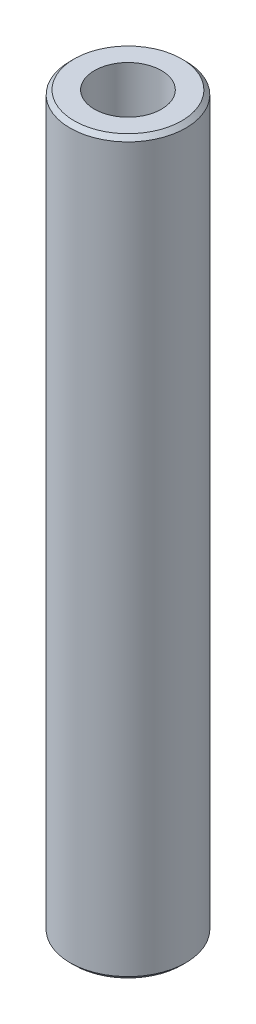
ISO-10303-21;
HEADER;
FILE_DESCRIPTION(('STEP AP214'),'2;1');
FILE_NAME('part.step','',(''),(''),'','','');
FILE_SCHEMA(('AUTOMOTIVE_DESIGN { 1 0 10303 214 1 1 1 1 }'));
ENDSEC;
DATA;
#1=APPLICATION_CONTEXT('core data for automotive mechanical design processes');
#2=APPLICATION_PROTOCOL_DEFINITION('international standard','automotive_design',2000,#1);
#3=PRODUCT_CONTEXT('',#1,'mechanical');
#4=PRODUCT('Part','Part','',(#3));
#5=PRODUCT_RELATED_PRODUCT_CATEGORY('part','',(#4));
#6=PRODUCT_DEFINITION_FORMATION('','',#4);
#7=PRODUCT_DEFINITION_CONTEXT('part definition',#1,'design');
#8=PRODUCT_DEFINITION('design','',#6,#7);
#9=PRODUCT_DEFINITION_SHAPE('','',#8);
#10=(LENGTH_UNIT() NAMED_UNIT(*) SI_UNIT(.MILLI.,.METRE.));
#11=(NAMED_UNIT(*) PLANE_ANGLE_UNIT() SI_UNIT($,.RADIAN.));
#12=(NAMED_UNIT(*) SI_UNIT($,.STERADIAN.) SOLID_ANGLE_UNIT());
#13=UNCERTAINTY_MEASURE_WITH_UNIT(LENGTH_MEASURE(1.E-05),#10,'distance_accuracy_value','');
#14=(GEOMETRIC_REPRESENTATION_CONTEXT(3) GLOBAL_UNCERTAINTY_ASSIGNED_CONTEXT((#13)) GLOBAL_UNIT_ASSIGNED_CONTEXT((#10,
#11,#12)) REPRESENTATION_CONTEXT('',''));
#15=CARTESIAN_POINT('',(0.,0.,0.));
#16=DIRECTION('',(0.,0.,1.));
#17=DIRECTION('',(1.,0.,0.));
#18=AXIS2_PLACEMENT_3D('',#15,#16,#17);
#19=CARTESIAN_POINT('',(0.,600.,0.));
#20=DIRECTION('',(0.,-1.,0.));
#21=DIRECTION('',(0.,0.,-1.));
#22=AXIS2_PLACEMENT_3D('',#19,#20,#21);
#23=CYLINDRICAL_SURFACE('',#22,47.5);
#24=CARTESIAN_POINT('',(0.,596.585918675975,0.));
#25=DIRECTION('',(0.,1.,0.));
#26=DIRECTION('',(0.,0.,1.));
#27=AXIS2_PLACEMENT_3D('',#24,#25,#26);
#28=CIRCLE('',#27,47.5);
#29=CARTESIAN_POINT('',(0.,596.585918675975,47.5));
#30=VERTEX_POINT('',#29);
#31=EDGE_CURVE('E50',#30,#30,#28,.F.);
#32=ORIENTED_EDGE('',*,*,#31,.T.);
#33=EDGE_LOOP('',(#32));
#34=FACE_BOUND('',#33,.T.);
#35=CARTESIAN_POINT('',(0.,3.41408132402532,0.));
#36=DIRECTION('',(0.,1.,0.));
#37=DIRECTION('',(0.,0.,1.));
#38=AXIS2_PLACEMENT_3D('',#35,#36,#37);
#39=CIRCLE('',#38,47.5);
#40=CARTESIAN_POINT('',(0.,3.41408132402532,47.5));
#41=VERTEX_POINT('',#40);
#42=EDGE_CURVE('E51',#41,#41,#39,.T.);
#43=ORIENTED_EDGE('',*,*,#42,.T.);
#44=EDGE_LOOP('',(#43));
#45=FACE_BOUND('',#44,.T.);
#46=ADVANCED_FACE('F39',(#34,#45),#23,.T.);
#47=CARTESIAN_POINT('',(0.,600.,0.));
#48=DIRECTION('',(0.,1.,0.));
#49=DIRECTION('',(0.,0.,1.));
#50=AXIS2_PLACEMENT_3D('',#47,#48,#49);
#51=PLANE('',#50);
#52=CARTESIAN_POINT('',(0.,600.,0.));
#53=DIRECTION('',(0.,1.,0.));
#54=DIRECTION('',(0.,0.,1.));
#55=AXIS2_PLACEMENT_3D('',#52,#53,#54);
#56=CIRCLE('',#55,44.0859186759746);
#57=CARTESIAN_POINT('',(0.,600.,44.0859186759746));
#58=VERTEX_POINT('',#57);
#59=EDGE_CURVE('E54',#58,#58,#56,.T.);
#60=ORIENTED_EDGE('',*,*,#59,.T.);
#61=EDGE_LOOP('',(#60));
#62=FACE_BOUND('',#61,.T.);
#63=CARTESIAN_POINT('',(0.,600.,0.));
#64=DIRECTION('',(0.,1.,0.));
#65=DIRECTION('',(0.,0.,1.));
#66=AXIS2_PLACEMENT_3D('',#63,#64,#65);
#67=CIRCLE('',#66,27.5000461166282);
#68=CARTESIAN_POINT('',(0.,600.,27.5000461166282));
#69=VERTEX_POINT('',#68);
#70=EDGE_CURVE('E58',#69,#69,#67,.T.);
#71=ORIENTED_EDGE('',*,*,#70,.F.);
#72=EDGE_LOOP('',(#71));
#73=FACE_BOUND('',#72,.T.);
#74=ADVANCED_FACE('F69',(#62,#73),#51,.T.);
#75=CARTESIAN_POINT('',(0.,0.,0.));
#76=DIRECTION('',(0.,1.,0.));
#77=DIRECTION('',(0.,0.,1.));
#78=AXIS2_PLACEMENT_3D('',#75,#76,#77);
#79=PLANE('',#78);
#80=CARTESIAN_POINT('',(0.,0.,0.));
#81=DIRECTION('',(0.,1.,0.));
#82=DIRECTION('',(0.,0.,1.));
#83=AXIS2_PLACEMENT_3D('',#80,#81,#82);
#84=CIRCLE('',#83,44.0859186759746);
#85=CARTESIAN_POINT('',(0.,0.,44.0859186759746));
#86=VERTEX_POINT('',#85);
#87=EDGE_CURVE('E10',#86,#86,#84,.F.);
#88=ORIENTED_EDGE('',*,*,#87,.T.);
#89=EDGE_LOOP('',(#88));
#90=FACE_BOUND('',#89,.T.);
#91=CARTESIAN_POINT('',(0.,0.,0.));
#92=DIRECTION('',(0.,1.,0.));
#93=DIRECTION('',(0.,0.,1.));
#94=AXIS2_PLACEMENT_3D('',#91,#92,#93);
#95=CIRCLE('',#94,27.5000461166282);
#96=CARTESIAN_POINT('',(0.,0.,27.5000461166282));
#97=VERTEX_POINT('',#96);
#98=EDGE_CURVE('E63',#97,#97,#95,.T.);
#99=ORIENTED_EDGE('',*,*,#98,.T.);
#100=EDGE_LOOP('',(#99));
#101=FACE_BOUND('',#100,.T.);
#102=ADVANCED_FACE('F75',(#90,#101),#79,.F.);
#103=CARTESIAN_POINT('',(0.,600.,0.));
#104=DIRECTION('',(0.,-1.,0.));
#105=DIRECTION('',(0.,0.,-1.));
#106=AXIS2_PLACEMENT_3D('',#103,#104,#105);
#107=CYLINDRICAL_SURFACE('',#106,27.5000461166282);
#108=ORIENTED_EDGE('',*,*,#70,.T.);
#109=EDGE_LOOP('',(#108));
#110=FACE_BOUND('',#109,.T.);
#111=ORIENTED_EDGE('',*,*,#98,.F.);
#112=EDGE_LOOP('',(#111));
#113=FACE_BOUND('',#112,.T.);
#114=ADVANCED_FACE('F70',(#110,#113),#107,.F.);
#115=CARTESIAN_POINT('',(0.,600.,0.));
#116=DIRECTION('',(0.,-1.,0.));
#117=DIRECTION('',(0.,0.,-1.));
#118=AXIS2_PLACEMENT_3D('',#115,#116,#117);
#119=CONICAL_SURFACE('',#118,44.0859186759746,0.785398163397451);
#120=ORIENTED_EDGE('',*,*,#31,.F.);
#121=EDGE_LOOP('',(#120));
#122=FACE_BOUND('',#121,.T.);
#123=ORIENTED_EDGE('',*,*,#59,.F.);
#124=EDGE_LOOP('',(#123));
#125=FACE_BOUND('',#124,.T.);
#126=ADVANCED_FACE('F81',(#122,#125),#119,.T.);
#127=CARTESIAN_POINT('',(0.,3.41408132402532,0.));
#128=DIRECTION('',(0.,1.,0.));
#129=DIRECTION('',(0.,0.,1.));
#130=AXIS2_PLACEMENT_3D('',#127,#128,#129);
#131=CONICAL_SURFACE('',#130,47.5,0.785398163397459);
#132=ORIENTED_EDGE('',*,*,#87,.F.);
#133=EDGE_LOOP('',(#132));
#134=FACE_BOUND('',#133,.T.);
#135=ORIENTED_EDGE('',*,*,#42,.F.);
#136=EDGE_LOOP('',(#135));
#137=FACE_BOUND('',#136,.T.);
#138=ADVANCED_FACE('F45',(#134,#137),#131,.T.);
#139=CLOSED_SHELL('',(#46,#74,#102,#114,#126,#138));
#140=MANIFOLD_SOLID_BREP('B2',#139);
#141=ADVANCED_BREP_SHAPE_REPRESENTATION('',(#18,#140),#14);
#142=SHAPE_DEFINITION_REPRESENTATION(#9,#141);
ENDSEC;
END-ISO-10303-21;
